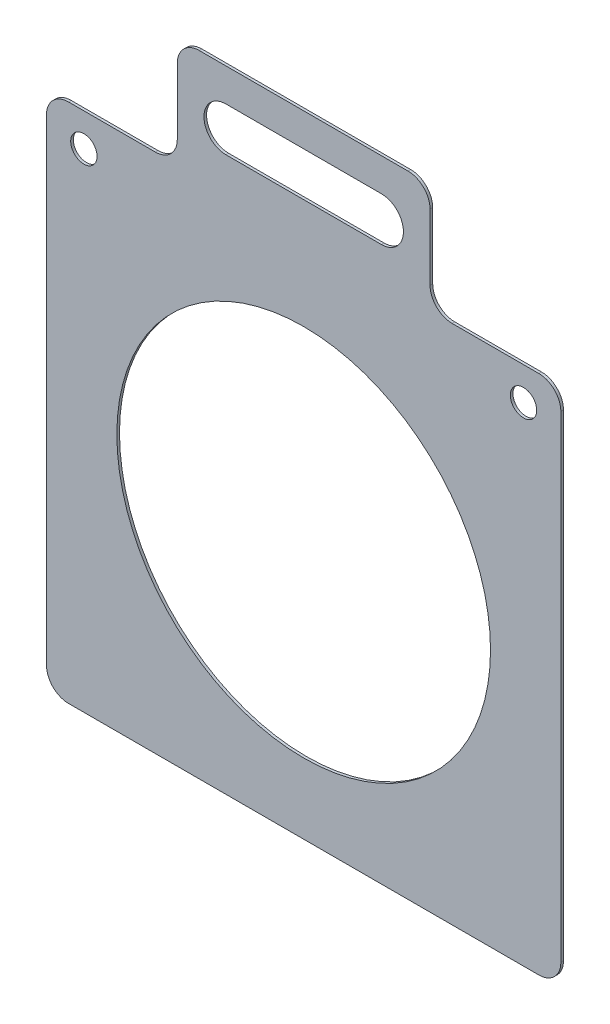
ISO-10303-21;
HEADER;
FILE_DESCRIPTION(('STEP AP214'),'2;1');
FILE_NAME('part.step','',(''),(''),'','','');
FILE_SCHEMA(('AUTOMOTIVE_DESIGN { 1 0 10303 214 1 1 1 1 }'));
ENDSEC;
DATA;
#1=APPLICATION_CONTEXT('core data for automotive mechanical design processes');
#2=APPLICATION_PROTOCOL_DEFINITION('international standard','automotive_design',2000,#1);
#3=PRODUCT_CONTEXT('',#1,'mechanical');
#4=PRODUCT('Part','Part','',(#3));
#5=PRODUCT_RELATED_PRODUCT_CATEGORY('part','',(#4));
#6=PRODUCT_DEFINITION_FORMATION('','',#4);
#7=PRODUCT_DEFINITION_CONTEXT('part definition',#1,'design');
#8=PRODUCT_DEFINITION('design','',#6,#7);
#9=PRODUCT_DEFINITION_SHAPE('','',#8);
#10=(LENGTH_UNIT() NAMED_UNIT(*) SI_UNIT(.MILLI.,.METRE.));
#11=(NAMED_UNIT(*) PLANE_ANGLE_UNIT() SI_UNIT($,.RADIAN.));
#12=(NAMED_UNIT(*) SI_UNIT($,.STERADIAN.) SOLID_ANGLE_UNIT());
#13=UNCERTAINTY_MEASURE_WITH_UNIT(LENGTH_MEASURE(1.E-05),#10,'distance_accuracy_value','');
#14=(GEOMETRIC_REPRESENTATION_CONTEXT(3) GLOBAL_UNCERTAINTY_ASSIGNED_CONTEXT((#13)) GLOBAL_UNIT_ASSIGNED_CONTEXT((#10,
#11,#12)) REPRESENTATION_CONTEXT('',''));
#15=CARTESIAN_POINT('',(0.,0.,0.));
#16=DIRECTION('',(0.,0.,1.));
#17=DIRECTION('',(1.,0.,0.));
#18=AXIS2_PLACEMENT_3D('',#15,#16,#17);
#19=CARTESIAN_POINT('',(-117.,120.000000000001,1.20000000000005));
#20=DIRECTION('',(0.,-1.,0.));
#21=DIRECTION('',(1.,0.,0.));
#22=AXIS2_PLACEMENT_3D('',#19,#20,#21);
#23=PLANE('',#22);
#24=DIRECTION('',(-1.,0.,0.));
#25=VECTOR('',#24,1.);
#26=CARTESIAN_POINT('',(-117.,120.000000000001,1.20000000000005));
#27=LINE('',#26,#25);
#28=CARTESIAN_POINT('',(-67.5000000000001,120.000000000001,1.20000000000005));
#29=VERTEX_POINT('',#28);
#30=CARTESIAN_POINT('',(-107.,120.,1.20000000000005));
#31=VERTEX_POINT('',#30);
#32=EDGE_CURVE('E276',#29,#31,#27,.T.);
#33=ORIENTED_EDGE('',*,*,#32,.F.);
#34=DIRECTION('',(0.,0.,1.));
#35=VECTOR('',#34,1.);
#36=CARTESIAN_POINT('',(-67.5000000000001,120.000000000001,1.20000000000005));
#37=LINE('',#36,#35);
#38=CARTESIAN_POINT('',(-67.5000000000001,120.000000000001,0.));
#39=VERTEX_POINT('',#38);
#40=EDGE_CURVE('E361',#29,#39,#37,.F.);
#41=ORIENTED_EDGE('',*,*,#40,.T.);
#42=DIRECTION('',(-1.,0.,0.));
#43=VECTOR('',#42,1.);
#44=CARTESIAN_POINT('',(-117.,120.000000000001,0.));
#45=LINE('',#44,#43);
#46=CARTESIAN_POINT('',(-107.,120.,0.));
#47=VERTEX_POINT('',#46);
#48=EDGE_CURVE('E291',#39,#47,#45,.T.);
#49=ORIENTED_EDGE('',*,*,#48,.T.);
#50=DIRECTION('',(0.,0.,-1.));
#51=VECTOR('',#50,1.);
#52=CARTESIAN_POINT('',(-107.,120.,1.20000000000005));
#53=LINE('',#52,#51);
#54=EDGE_CURVE('E358',#47,#31,#53,.F.);
#55=ORIENTED_EDGE('',*,*,#54,.T.);
#56=EDGE_LOOP('',(#33,#41,#49,#55));
#57=FACE_BOUND('',#56,.T.);
#58=ADVANCED_FACE('F40',(#57),#23,.F.);
#59=CARTESIAN_POINT('',(0.,0.,1.19999999999998));
#60=DIRECTION('',(0.,0.,1.));
#61=DIRECTION('',(1.,0.,0.));
#62=AXIS2_PLACEMENT_3D('',#59,#60,#61);
#63=PLANE('',#62);
#64=CARTESIAN_POINT('',(-100.,105.,1.20000000000005));
#65=DIRECTION('',(0.,0.,1.));
#66=DIRECTION('',(1.,0.,0.));
#67=AXIS2_PLACEMENT_3D('',#64,#65,#66);
#68=CIRCLE('',#67,6.);
#69=CARTESIAN_POINT('',(-94.0000000000003,105.,1.20000000000005));
#70=VERTEX_POINT('',#69);
#71=EDGE_CURVE('E247',#70,#70,#68,.T.);
#72=ORIENTED_EDGE('',*,*,#71,.F.);
#73=EDGE_LOOP('',(#72));
#74=FACE_BOUND('',#73,.T.);
#75=DIRECTION('',(0.,1.,0.));
#76=VECTOR('',#75,1.);
#77=CARTESIAN_POINT('',(57.5000000000002,170.000000000002,1.19999999999999));
#78=LINE('',#77,#76);
#79=CARTESIAN_POINT('',(57.5000000000003,130.000000000001,1.19999999999999));
#80=VERTEX_POINT('',#79);
#81=CARTESIAN_POINT('',(57.5000000000001,160.000000000002,1.19999999999999));
#82=VERTEX_POINT('',#81);
#83=EDGE_CURVE('E217',#80,#82,#78,.T.);
#84=ORIENTED_EDGE('',*,*,#83,.T.);
#85=CARTESIAN_POINT('',(47.5,160.000000000002,1.20000000000005));
#86=DIRECTION('',(0.,0.,1.));
#87=DIRECTION('',(1.,0.,0.));
#88=AXIS2_PLACEMENT_3D('',#85,#86,#87);
#89=CIRCLE('',#88,10.);
#90=CARTESIAN_POINT('',(47.5000000000002,170.000000000002,1.19999999999999));
#91=VERTEX_POINT('',#90);
#92=EDGE_CURVE('E325',#82,#91,#89,.T.);
#93=ORIENTED_EDGE('',*,*,#92,.T.);
#94=DIRECTION('',(-1.,0.,0.));
#95=VECTOR('',#94,1.);
#96=CARTESIAN_POINT('',(-57.5000000000002,170.000000000002,1.20000000000005));
#97=LINE('',#96,#95);
#98=CARTESIAN_POINT('',(-47.5000000000001,170.000000000002,1.20000000000005));
#99=VERTEX_POINT('',#98);
#100=EDGE_CURVE('E225',#91,#99,#97,.T.);
#101=ORIENTED_EDGE('',*,*,#100,.T.);
#102=CARTESIAN_POINT('',(-47.5,160.000000000002,1.20000000000005));
#103=DIRECTION('',(0.,0.,1.));
#104=DIRECTION('',(1.,0.,0.));
#105=AXIS2_PLACEMENT_3D('',#102,#103,#104);
#106=CIRCLE('',#105,10.);
#107=CARTESIAN_POINT('',(-57.5,160.000000000002,1.20000000000005));
#108=VERTEX_POINT('',#107);
#109=EDGE_CURVE('E322',#99,#108,#106,.T.);
#110=ORIENTED_EDGE('',*,*,#109,.T.);
#111=DIRECTION('',(0.,-1.,0.));
#112=VECTOR('',#111,1.);
#113=CARTESIAN_POINT('',(-57.4999999999999,120.000000000002,1.20000000000005));
#114=LINE('',#113,#112);
#115=CARTESIAN_POINT('',(-57.5000000000001,130.000000000001,1.19999999999998));
#116=VERTEX_POINT('',#115);
#117=EDGE_CURVE('E229',#108,#116,#114,.T.);
#118=ORIENTED_EDGE('',*,*,#117,.T.);
#119=CARTESIAN_POINT('',(-67.5,130.000000000001,1.20000000000004));
#120=DIRECTION('',(0.,0.,1.));
#121=DIRECTION('',(1.,0.,0.));
#122=AXIS2_PLACEMENT_3D('',#119,#120,#121);
#123=CIRCLE('',#122,10.);
#124=EDGE_CURVE('E49',#116,#29,#123,.F.);
#125=ORIENTED_EDGE('',*,*,#124,.T.);
#126=ORIENTED_EDGE('',*,*,#32,.T.);
#127=CARTESIAN_POINT('',(-107.,110.,1.20000000000005));
#128=DIRECTION('',(0.,0.,1.));
#129=DIRECTION('',(1.,0.,0.));
#130=AXIS2_PLACEMENT_3D('',#127,#128,#129);
#131=CIRCLE('',#130,10.);
#132=CARTESIAN_POINT('',(-117.,110.,1.20000000000005));
#133=VERTEX_POINT('',#132);
#134=EDGE_CURVE('E319',#31,#133,#131,.T.);
#135=ORIENTED_EDGE('',*,*,#134,.T.);
#136=DIRECTION('',(0.,-1.,0.));
#137=VECTOR('',#136,1.);
#138=CARTESIAN_POINT('',(-117.,120.000000000001,1.20000000000005));
#139=LINE('',#138,#137);
#140=CARTESIAN_POINT('',(-117.,-107.,1.20000000000003));
#141=VERTEX_POINT('',#140);
#142=EDGE_CURVE('E263',#133,#141,#139,.T.);
#143=ORIENTED_EDGE('',*,*,#142,.T.);
#144=CARTESIAN_POINT('',(-107.,-107.,1.20000000000003));
#145=DIRECTION('',(0.,0.,1.));
#146=DIRECTION('',(1.,0.,0.));
#147=AXIS2_PLACEMENT_3D('',#144,#145,#146);
#148=CIRCLE('',#147,10.);
#149=CARTESIAN_POINT('',(-107.,-117.,1.20000000000003));
#150=VERTEX_POINT('',#149);
#151=EDGE_CURVE('E313',#141,#150,#148,.T.);
#152=ORIENTED_EDGE('',*,*,#151,.T.);
#153=DIRECTION('',(1.,0.,0.));
#154=VECTOR('',#153,1.);
#155=CARTESIAN_POINT('',(-117.,-117.,1.20000000000003));
#156=LINE('',#155,#154);
#157=CARTESIAN_POINT('',(107.,-117.,1.19999999999998));
#158=VERTEX_POINT('',#157);
#159=EDGE_CURVE('E267',#150,#158,#156,.T.);
#160=ORIENTED_EDGE('',*,*,#159,.T.);
#161=CARTESIAN_POINT('',(107.,-107.,1.19999999999998));
#162=DIRECTION('',(0.,0.,1.));
#163=DIRECTION('',(1.,0.,0.));
#164=AXIS2_PLACEMENT_3D('',#161,#162,#163);
#165=CIRCLE('',#164,10.);
#166=CARTESIAN_POINT('',(117.,-107.,1.19999999999998));
#167=VERTEX_POINT('',#166);
#168=EDGE_CURVE('E316',#158,#167,#165,.T.);
#169=ORIENTED_EDGE('',*,*,#168,.T.);
#170=DIRECTION('',(0.,1.,0.));
#171=VECTOR('',#170,1.);
#172=CARTESIAN_POINT('',(117.,120.,1.19999999999998));
#173=LINE('',#172,#171);
#174=CARTESIAN_POINT('',(117.,110.,1.19999999999998));
#175=VERTEX_POINT('',#174);
#176=EDGE_CURVE('E272',#167,#175,#173,.T.);
#177=ORIENTED_EDGE('',*,*,#176,.T.);
#178=CARTESIAN_POINT('',(107.,110.000000000001,1.19999999999998));
#179=DIRECTION('',(0.,0.,1.));
#180=DIRECTION('',(1.,0.,0.));
#181=AXIS2_PLACEMENT_3D('',#178,#179,#180);
#182=CIRCLE('',#181,10.);
#183=CARTESIAN_POINT('',(107.,120.000000000001,1.19999999999998));
#184=VERTEX_POINT('',#183);
#185=EDGE_CURVE('E310',#175,#184,#182,.T.);
#186=ORIENTED_EDGE('',*,*,#185,.T.);
#187=CARTESIAN_POINT('',(67.5000000000001,120.000000000001,1.19999999999998));
#188=VERTEX_POINT('',#187);
#189=EDGE_CURVE('E280',#184,#188,#27,.T.);
#190=ORIENTED_EDGE('',*,*,#189,.T.);
#191=CARTESIAN_POINT('',(67.5000000000003,130.000000000001,1.19999999999998));
#192=DIRECTION('',(0.,0.,1.));
#193=DIRECTION('',(1.,0.,0.));
#194=AXIS2_PLACEMENT_3D('',#191,#192,#193);
#195=CIRCLE('',#194,10.);
#196=EDGE_CURVE('E384',#188,#80,#195,.F.);
#197=ORIENTED_EDGE('',*,*,#196,.T.);
#198=EDGE_LOOP('',(#84,#93,#101,#110,#118,#125,#126,#135,#143,#152,#160,#169,#177,#186,#190,#197));
#199=FACE_BOUND('',#198,.T.);
#200=CARTESIAN_POINT('',(0.,0.,1.19999999999998));
#201=DIRECTION('',(0.,0.,1.));
#202=DIRECTION('',(1.,0.,0.));
#203=AXIS2_PLACEMENT_3D('',#200,#201,#202);
#204=CIRCLE('',#203,85.);
#205=CARTESIAN_POINT('',(85.0000000000002,0.,1.19999999999998));
#206=VERTEX_POINT('',#205);
#207=EDGE_CURVE('E255',#206,#206,#204,.T.);
#208=ORIENTED_EDGE('',*,*,#207,.F.);
#209=EDGE_LOOP('',(#208));
#210=FACE_BOUND('',#209,.T.);
#211=CARTESIAN_POINT('',(100.,105.000000000001,1.19999999999998));
#212=DIRECTION('',(0.,0.,1.));
#213=DIRECTION('',(-1.,0.,0.));
#214=AXIS2_PLACEMENT_3D('',#211,#212,#213);
#215=CIRCLE('',#214,6.);
#216=CARTESIAN_POINT('',(94.0000000000002,105.000000000001,1.19999999999998));
#217=VERTEX_POINT('',#216);
#218=EDGE_CURVE('E237',#217,#217,#215,.T.);
#219=ORIENTED_EDGE('',*,*,#218,.F.);
#220=EDGE_LOOP('',(#219));
#221=FACE_BOUND('',#220,.T.);
#222=DIRECTION('',(1.,0.,0.));
#223=VECTOR('',#222,1.);
#224=CARTESIAN_POINT('',(-35.3706002300001,134.999999999999,1.20000000000005));
#225=LINE('',#224,#223);
#226=CARTESIAN_POINT('',(-35.3706002300001,134.999999999999,1.20000000000005));
#227=VERTEX_POINT('',#226);
#228=CARTESIAN_POINT('',(35.3706002300002,135.,1.19999999999999));
#229=VERTEX_POINT('',#228);
#230=EDGE_CURVE('E195',#227,#229,#225,.T.);
#231=ORIENTED_EDGE('',*,*,#230,.F.);
#232=CARTESIAN_POINT('',(-35.3706002300002,145.000000000002,1.20000000000005));
#233=DIRECTION('',(0.,0.,1.));
#234=DIRECTION('',(1.,0.,0.));
#235=AXIS2_PLACEMENT_3D('',#232,#233,#234);
#236=CIRCLE('',#235,10.0000000000015);
#237=CARTESIAN_POINT('',(-35.3706002300001,155.000000000002,1.20000000000005));
#238=VERTEX_POINT('',#237);
#239=EDGE_CURVE('E202',#238,#227,#236,.T.);
#240=ORIENTED_EDGE('',*,*,#239,.F.);
#241=DIRECTION('',(-1.,0.,0.));
#242=VECTOR('',#241,1.);
#243=CARTESIAN_POINT('',(-35.3706002300001,155.000000000002,1.20000000000005));
#244=LINE('',#243,#242);
#245=CARTESIAN_POINT('',(35.3706002300001,155.000000000002,1.19999999999999));
#246=VERTEX_POINT('',#245);
#247=EDGE_CURVE('E206',#246,#238,#244,.T.);
#248=ORIENTED_EDGE('',*,*,#247,.F.);
#249=CARTESIAN_POINT('',(35.3706002300001,145.000000000002,1.19999999999999));
#250=DIRECTION('',(0.,0.,1.));
#251=DIRECTION('',(1.,0.,0.));
#252=AXIS2_PLACEMENT_3D('',#249,#250,#251);
#253=CIRCLE('',#252,10.0000000000015);
#254=EDGE_CURVE('E185',#229,#246,#253,.T.);
#255=ORIENTED_EDGE('',*,*,#254,.F.);
#256=EDGE_LOOP('',(#231,#240,#248,#255));
#257=FACE_BOUND('',#256,.T.);
#258=ADVANCED_FACE('F204',(#74,#199,#210,#221,#257),#63,.T.);
#259=CARTESIAN_POINT('',(0.,0.,0.));
#260=DIRECTION('',(0.,0.,1.));
#261=DIRECTION('',(1.,0.,0.));
#262=AXIS2_PLACEMENT_3D('',#259,#260,#261);
#263=PLANE('',#262);
#264=DIRECTION('',(1.,0.,0.));
#265=VECTOR('',#264,1.);
#266=CARTESIAN_POINT('',(-57.5000000000002,170.000000000002,0.));
#267=LINE('',#266,#265);
#268=CARTESIAN_POINT('',(-47.5000000000001,170.000000000002,0.));
#269=VERTEX_POINT('',#268);
#270=CARTESIAN_POINT('',(47.5000000000002,170.000000000002,0.));
#271=VERTEX_POINT('',#270);
#272=EDGE_CURVE('E236',#269,#271,#267,.T.);
#273=ORIENTED_EDGE('',*,*,#272,.T.);
#274=CARTESIAN_POINT('',(47.5,160.000000000002,0.));
#275=DIRECTION('',(0.,0.,1.));
#276=DIRECTION('',(1.,0.,0.));
#277=AXIS2_PLACEMENT_3D('',#274,#275,#276);
#278=CIRCLE('',#277,10.);
#279=CARTESIAN_POINT('',(57.5000000000001,160.000000000002,0.));
#280=VERTEX_POINT('',#279);
#281=EDGE_CURVE('E348',#271,#280,#278,.F.);
#282=ORIENTED_EDGE('',*,*,#281,.T.);
#283=DIRECTION('',(0.,-1.,0.));
#284=VECTOR('',#283,1.);
#285=CARTESIAN_POINT('',(57.5000000000002,170.000000000002,0.));
#286=LINE('',#285,#284);
#287=CARTESIAN_POINT('',(57.5000000000003,130.000000000001,0.));
#288=VERTEX_POINT('',#287);
#289=EDGE_CURVE('E246',#280,#288,#286,.T.);
#290=ORIENTED_EDGE('',*,*,#289,.T.);
#291=CARTESIAN_POINT('',(67.5000000000003,130.000000000001,0.));
#292=DIRECTION('',(0.,0.,1.));
#293=DIRECTION('',(1.,0.,0.));
#294=AXIS2_PLACEMENT_3D('',#291,#292,#293);
#295=CIRCLE('',#294,10.);
#296=CARTESIAN_POINT('',(67.5000000000001,120.000000000001,0.));
#297=VERTEX_POINT('',#296);
#298=EDGE_CURVE('E387',#288,#297,#295,.T.);
#299=ORIENTED_EDGE('',*,*,#298,.T.);
#300=CARTESIAN_POINT('',(107.,120.000000000001,0.));
#301=VERTEX_POINT('',#300);
#302=EDGE_CURVE('E268',#301,#297,#45,.T.);
#303=ORIENTED_EDGE('',*,*,#302,.F.);
#304=CARTESIAN_POINT('',(107.,110.000000000001,0.));
#305=DIRECTION('',(0.,0.,1.));
#306=DIRECTION('',(1.,0.,0.));
#307=AXIS2_PLACEMENT_3D('',#304,#305,#306);
#308=CIRCLE('',#307,10.);
#309=CARTESIAN_POINT('',(117.,110.,0.));
#310=VERTEX_POINT('',#309);
#311=EDGE_CURVE('E335',#301,#310,#308,.F.);
#312=ORIENTED_EDGE('',*,*,#311,.T.);
#313=DIRECTION('',(0.,1.,0.));
#314=VECTOR('',#313,1.);
#315=CARTESIAN_POINT('',(117.,120.,0.));
#316=LINE('',#315,#314);
#317=CARTESIAN_POINT('',(117.,-107.,0.));
#318=VERTEX_POINT('',#317);
#319=EDGE_CURVE('E287',#318,#310,#316,.T.);
#320=ORIENTED_EDGE('',*,*,#319,.F.);
#321=CARTESIAN_POINT('',(107.,-107.,0.));
#322=DIRECTION('',(0.,0.,1.));
#323=DIRECTION('',(1.,0.,0.));
#324=AXIS2_PLACEMENT_3D('',#321,#322,#323);
#325=CIRCLE('',#324,10.);
#326=CARTESIAN_POINT('',(107.,-117.,0.));
#327=VERTEX_POINT('',#326);
#328=EDGE_CURVE('E56',#318,#327,#325,.F.);
#329=ORIENTED_EDGE('',*,*,#328,.T.);
#330=DIRECTION('',(1.,0.,0.));
#331=VECTOR('',#330,1.);
#332=CARTESIAN_POINT('',(-117.,-117.,0.));
#333=LINE('',#332,#331);
#334=CARTESIAN_POINT('',(-107.,-117.,0.));
#335=VERTEX_POINT('',#334);
#336=EDGE_CURVE('E284',#335,#327,#333,.T.);
#337=ORIENTED_EDGE('',*,*,#336,.F.);
#338=CARTESIAN_POINT('',(-107.,-107.,0.));
#339=DIRECTION('',(0.,0.,1.));
#340=DIRECTION('',(1.,0.,0.));
#341=AXIS2_PLACEMENT_3D('',#338,#339,#340);
#342=CIRCLE('',#341,10.);
#343=CARTESIAN_POINT('',(-117.,-107.,0.));
#344=VERTEX_POINT('',#343);
#345=EDGE_CURVE('E64',#335,#344,#342,.F.);
#346=ORIENTED_EDGE('',*,*,#345,.T.);
#347=DIRECTION('',(0.,-1.,0.));
#348=VECTOR('',#347,1.);
#349=CARTESIAN_POINT('',(-117.,120.000000000001,0.));
#350=LINE('',#349,#348);
#351=CARTESIAN_POINT('',(-117.,110.,0.));
#352=VERTEX_POINT('',#351);
#353=EDGE_CURVE('E259',#352,#344,#350,.T.);
#354=ORIENTED_EDGE('',*,*,#353,.F.);
#355=CARTESIAN_POINT('',(-107.,110.,0.));
#356=DIRECTION('',(0.,0.,1.));
#357=DIRECTION('',(1.,0.,0.));
#358=AXIS2_PLACEMENT_3D('',#355,#356,#357);
#359=CIRCLE('',#358,10.);
#360=EDGE_CURVE('E342',#352,#47,#359,.F.);
#361=ORIENTED_EDGE('',*,*,#360,.T.);
#362=ORIENTED_EDGE('',*,*,#48,.F.);
#363=CARTESIAN_POINT('',(-67.5,130.000000000001,0.));
#364=DIRECTION('',(0.,0.,1.));
#365=DIRECTION('',(1.,0.,0.));
#366=AXIS2_PLACEMENT_3D('',#363,#364,#365);
#367=CIRCLE('',#366,10.);
#368=CARTESIAN_POINT('',(-57.5000000000001,130.000000000001,0.));
#369=VERTEX_POINT('',#368);
#370=EDGE_CURVE('E11',#39,#369,#367,.T.);
#371=ORIENTED_EDGE('',*,*,#370,.T.);
#372=DIRECTION('',(0.,1.,0.));
#373=VECTOR('',#372,1.);
#374=CARTESIAN_POINT('',(-57.4999999999999,120.000000000002,0.));
#375=LINE('',#374,#373);
#376=CARTESIAN_POINT('',(-57.5,160.000000000002,0.));
#377=VERTEX_POINT('',#376);
#378=EDGE_CURVE('E410',#369,#377,#375,.T.);
#379=ORIENTED_EDGE('',*,*,#378,.T.);
#380=CARTESIAN_POINT('',(-47.5,160.000000000002,0.));
#381=DIRECTION('',(0.,0.,1.));
#382=DIRECTION('',(1.,0.,0.));
#383=AXIS2_PLACEMENT_3D('',#380,#381,#382);
#384=CIRCLE('',#383,10.);
#385=EDGE_CURVE('E345',#377,#269,#384,.F.);
#386=ORIENTED_EDGE('',*,*,#385,.T.);
#387=EDGE_LOOP('',(#273,#282,#290,#299,#303,#312,#320,#329,#337,#346,#354,#361,#362,#371,#379,#386));
#388=FACE_BOUND('',#387,.T.);
#389=CARTESIAN_POINT('',(0.,0.,0.));
#390=DIRECTION('',(0.,0.,1.));
#391=DIRECTION('',(1.,0.,0.));
#392=AXIS2_PLACEMENT_3D('',#389,#390,#391);
#393=CIRCLE('',#392,85.);
#394=CARTESIAN_POINT('',(85.0000000000002,0.,0.));
#395=VERTEX_POINT('',#394);
#396=EDGE_CURVE('E251',#395,#395,#393,.T.);
#397=ORIENTED_EDGE('',*,*,#396,.T.);
#398=EDGE_LOOP('',(#397));
#399=FACE_BOUND('',#398,.T.);
#400=CARTESIAN_POINT('',(-100.,105.,0.));
#401=DIRECTION('',(0.,0.,1.));
#402=DIRECTION('',(1.,0.,0.));
#403=AXIS2_PLACEMENT_3D('',#400,#401,#402);
#404=CIRCLE('',#403,6.);
#405=CARTESIAN_POINT('',(-94.0000000000003,105.,0.));
#406=VERTEX_POINT('',#405);
#407=EDGE_CURVE('E241',#406,#406,#404,.T.);
#408=ORIENTED_EDGE('',*,*,#407,.T.);
#409=EDGE_LOOP('',(#408));
#410=FACE_BOUND('',#409,.T.);
#411=CARTESIAN_POINT('',(100.,105.000000000001,0.));
#412=DIRECTION('',(0.,0.,1.));
#413=DIRECTION('',(-1.,0.,0.));
#414=AXIS2_PLACEMENT_3D('',#411,#412,#413);
#415=CIRCLE('',#414,6.);
#416=CARTESIAN_POINT('',(94.0000000000002,105.000000000001,0.));
#417=VERTEX_POINT('',#416);
#418=EDGE_CURVE('E242',#417,#417,#415,.T.);
#419=ORIENTED_EDGE('',*,*,#418,.T.);
#420=EDGE_LOOP('',(#419));
#421=FACE_BOUND('',#420,.T.);
#422=DIRECTION('',(-1.,0.,0.));
#423=VECTOR('',#422,1.);
#424=CARTESIAN_POINT('',(-35.3706002300001,134.999999999999,0.));
#425=LINE('',#424,#423);
#426=CARTESIAN_POINT('',(35.3706002300001,134.999999999999,0.));
#427=VERTEX_POINT('',#426);
#428=CARTESIAN_POINT('',(-35.3706002300001,134.999999999999,0.));
#429=VERTEX_POINT('',#428);
#430=EDGE_CURVE('E233',#427,#429,#425,.T.);
#431=ORIENTED_EDGE('',*,*,#430,.F.);
#432=CARTESIAN_POINT('',(35.3706002300001,145.000000000002,0.));
#433=DIRECTION('',(0.,0.,1.));
#434=DIRECTION('',(1.,0.,0.));
#435=AXIS2_PLACEMENT_3D('',#432,#433,#434);
#436=CIRCLE('',#435,10.0000000000015);
#437=CARTESIAN_POINT('',(35.3706002300001,155.000000000004,0.));
#438=VERTEX_POINT('',#437);
#439=EDGE_CURVE('E187',#438,#427,#436,.F.);
#440=ORIENTED_EDGE('',*,*,#439,.F.);
#441=DIRECTION('',(1.,0.,0.));
#442=VECTOR('',#441,1.);
#443=CARTESIAN_POINT('',(-35.3706002300001,155.000000000002,0.));
#444=LINE('',#443,#442);
#445=CARTESIAN_POINT('',(-35.3706002300001,155.000000000002,0.));
#446=VERTEX_POINT('',#445);
#447=EDGE_CURVE('E420',#446,#438,#444,.T.);
#448=ORIENTED_EDGE('',*,*,#447,.F.);
#449=CARTESIAN_POINT('',(-35.3706002300002,145.000000000002,0.));
#450=DIRECTION('',(0.,0.,1.));
#451=DIRECTION('',(1.,0.,0.));
#452=AXIS2_PLACEMENT_3D('',#449,#450,#451);
#453=CIRCLE('',#452,10.0000000000015);
#454=EDGE_CURVE('E415',#429,#446,#453,.F.);
#455=ORIENTED_EDGE('',*,*,#454,.F.);
#456=EDGE_LOOP('',(#431,#440,#448,#455));
#457=FACE_BOUND('',#456,.T.);
#458=ADVANCED_FACE('F408',(#388,#399,#410,#421,#457),#263,.F.);
#459=CARTESIAN_POINT('',(-117.,120.000000000001,1.20000000000005));
#460=DIRECTION('',(1.,0.,0.));
#461=DIRECTION('',(0.,1.,0.));
#462=AXIS2_PLACEMENT_3D('',#459,#460,#461);
#463=PLANE('',#462);
#464=ORIENTED_EDGE('',*,*,#142,.F.);
#465=DIRECTION('',(0.,0.,-1.));
#466=VECTOR('',#465,1.);
#467=CARTESIAN_POINT('',(-117.,110.,1.20000000000005));
#468=LINE('',#467,#466);
#469=EDGE_CURVE('E367',#133,#352,#468,.T.);
#470=ORIENTED_EDGE('',*,*,#469,.T.);
#471=ORIENTED_EDGE('',*,*,#353,.T.);
#472=DIRECTION('',(0.,0.,-1.));
#473=VECTOR('',#472,1.);
#474=CARTESIAN_POINT('',(-117.,-107.,1.20000000000003));
#475=LINE('',#474,#473);
#476=EDGE_CURVE('E364',#344,#141,#475,.F.);
#477=ORIENTED_EDGE('',*,*,#476,.T.);
#478=EDGE_LOOP('',(#464,#470,#471,#477));
#479=FACE_BOUND('',#478,.T.);
#480=ADVANCED_FACE('F482',(#479),#463,.F.);
#481=CARTESIAN_POINT('',(-117.,-117.,1.20000000000003));
#482=DIRECTION('',(0.,1.,0.));
#483=DIRECTION('',(-1.,0.,0.));
#484=AXIS2_PLACEMENT_3D('',#481,#482,#483);
#485=PLANE('',#484);
#486=ORIENTED_EDGE('',*,*,#336,.T.);
#487=DIRECTION('',(0.,0.,-1.));
#488=VECTOR('',#487,1.);
#489=CARTESIAN_POINT('',(107.,-117.,1.19999999999998));
#490=LINE('',#489,#488);
#491=EDGE_CURVE('E381',#327,#158,#490,.F.);
#492=ORIENTED_EDGE('',*,*,#491,.T.);
#493=ORIENTED_EDGE('',*,*,#159,.F.);
#494=DIRECTION('',(0.,0.,-1.));
#495=VECTOR('',#494,1.);
#496=CARTESIAN_POINT('',(-107.,-117.,1.20000000000003));
#497=LINE('',#496,#495);
#498=EDGE_CURVE('E378',#150,#335,#497,.T.);
#499=ORIENTED_EDGE('',*,*,#498,.T.);
#500=EDGE_LOOP('',(#486,#492,#493,#499));
#501=FACE_BOUND('',#500,.T.);
#502=ADVANCED_FACE('F476',(#501),#485,.F.);
#503=CARTESIAN_POINT('',(117.,120.,1.19999999999998));
#504=DIRECTION('',(-1.,0.,0.));
#505=DIRECTION('',(0.,-1.,0.));
#506=AXIS2_PLACEMENT_3D('',#503,#504,#505);
#507=PLANE('',#506);
#508=ORIENTED_EDGE('',*,*,#176,.F.);
#509=DIRECTION('',(0.,0.,-1.));
#510=VECTOR('',#509,1.);
#511=CARTESIAN_POINT('',(117.,-107.,1.19999999999998));
#512=LINE('',#511,#510);
#513=EDGE_CURVE('E374',#167,#318,#512,.T.);
#514=ORIENTED_EDGE('',*,*,#513,.T.);
#515=ORIENTED_EDGE('',*,*,#319,.T.);
#516=DIRECTION('',(0.,0.,-1.));
#517=VECTOR('',#516,1.);
#518=CARTESIAN_POINT('',(117.,110.,1.19999999999998));
#519=LINE('',#518,#517);
#520=EDGE_CURVE('E371',#310,#175,#519,.F.);
#521=ORIENTED_EDGE('',*,*,#520,.T.);
#522=EDGE_LOOP('',(#508,#514,#515,#521));
#523=FACE_BOUND('',#522,.T.);
#524=ADVANCED_FACE('F468',(#523),#507,.F.);
#525=ORIENTED_EDGE('',*,*,#302,.T.);
#526=DIRECTION('',(0.,0.,1.));
#527=VECTOR('',#526,1.);
#528=CARTESIAN_POINT('',(67.5000000000003,120.,1.19999999999998));
#529=LINE('',#528,#527);
#530=EDGE_CURVE('E299',#297,#188,#529,.T.);
#531=ORIENTED_EDGE('',*,*,#530,.T.);
#532=ORIENTED_EDGE('',*,*,#189,.F.);
#533=DIRECTION('',(0.,0.,-1.));
#534=VECTOR('',#533,1.);
#535=CARTESIAN_POINT('',(107.,120.,1.19999999999998));
#536=LINE('',#535,#534);
#537=EDGE_CURVE('E295',#184,#301,#536,.T.);
#538=ORIENTED_EDGE('',*,*,#537,.T.);
#539=EDGE_LOOP('',(#525,#531,#532,#538));
#540=FACE_BOUND('',#539,.T.);
#541=ADVANCED_FACE('F457',(#540),#23,.F.);
#542=CARTESIAN_POINT('',(0.,0.,1.19999999999998));
#543=DIRECTION('',(0.,0.,-1.));
#544=DIRECTION('',(-1.,0.,0.));
#545=AXIS2_PLACEMENT_3D('',#542,#543,#544);
#546=CYLINDRICAL_SURFACE('',#545,85.);
#547=ORIENTED_EDGE('',*,*,#207,.T.);
#548=EDGE_LOOP('',(#547));
#549=FACE_BOUND('',#548,.T.);
#550=ORIENTED_EDGE('',*,*,#396,.F.);
#551=EDGE_LOOP('',(#550));
#552=FACE_BOUND('',#551,.T.);
#553=ADVANCED_FACE('F505',(#549,#552),#546,.F.);
#554=CARTESIAN_POINT('',(-100.,105.,1.20000000000005));
#555=DIRECTION('',(0.,0.,-1.));
#556=DIRECTION('',(-1.,0.,0.));
#557=AXIS2_PLACEMENT_3D('',#554,#555,#556);
#558=CYLINDRICAL_SURFACE('',#557,6.);
#559=ORIENTED_EDGE('',*,*,#71,.T.);
#560=EDGE_LOOP('',(#559));
#561=FACE_BOUND('',#560,.T.);
#562=ORIENTED_EDGE('',*,*,#407,.F.);
#563=EDGE_LOOP('',(#562));
#564=FACE_BOUND('',#563,.T.);
#565=ADVANCED_FACE('F510',(#561,#564),#558,.F.);
#566=CARTESIAN_POINT('',(100.,105.000000000001,1.19999999999998));
#567=DIRECTION('',(0.,0.,-1.));
#568=DIRECTION('',(-1.,0.,0.));
#569=AXIS2_PLACEMENT_3D('',#566,#567,#568);
#570=CYLINDRICAL_SURFACE('',#569,6.);
#571=ORIENTED_EDGE('',*,*,#218,.T.);
#572=EDGE_LOOP('',(#571));
#573=FACE_BOUND('',#572,.T.);
#574=ORIENTED_EDGE('',*,*,#418,.F.);
#575=EDGE_LOOP('',(#574));
#576=FACE_BOUND('',#575,.T.);
#577=ADVANCED_FACE('F538',(#573,#576),#570,.F.);
#578=CARTESIAN_POINT('',(57.5000000000002,170.000000000002,-125.399362039845));
#579=DIRECTION('',(1.,0.,0.));
#580=DIRECTION('',(0.,1.,0.));
#581=AXIS2_PLACEMENT_3D('',#578,#579,#580);
#582=PLANE('',#581);
#583=ORIENTED_EDGE('',*,*,#83,.F.);
#584=DIRECTION('',(0.,0.,1.));
#585=VECTOR('',#584,1.);
#586=CARTESIAN_POINT('',(57.5000000000003,130.000000000001,-125.399362039845));
#587=LINE('',#586,#585);
#588=EDGE_CURVE('E307',#80,#288,#587,.F.);
#589=ORIENTED_EDGE('',*,*,#588,.T.);
#590=ORIENTED_EDGE('',*,*,#289,.F.);
#591=DIRECTION('',(0.,0.,1.));
#592=VECTOR('',#591,1.);
#593=CARTESIAN_POINT('',(57.5000000000002,160.000000000002,-125.399362039845));
#594=LINE('',#593,#592);
#595=EDGE_CURVE('E303',#280,#82,#594,.T.);
#596=ORIENTED_EDGE('',*,*,#595,.T.);
#597=EDGE_LOOP('',(#583,#589,#590,#596));
#598=FACE_BOUND('',#597,.T.);
#599=ADVANCED_FACE('F536',(#598),#582,.T.);
#600=CARTESIAN_POINT('',(-57.5000000000003,170.000000000002,-125.399362039845));
#601=DIRECTION('',(0.,1.,0.));
#602=DIRECTION('',(0.,0.,1.));
#603=AXIS2_PLACEMENT_3D('',#600,#601,#602);
#604=PLANE('',#603);
#605=ORIENTED_EDGE('',*,*,#100,.F.);
#606=DIRECTION('',(0.,0.,1.));
#607=VECTOR('',#606,1.);
#608=CARTESIAN_POINT('',(47.5000000000002,170.000000000002,-125.399362039845));
#609=LINE('',#608,#607);
#610=EDGE_CURVE('E332',#91,#271,#609,.F.);
#611=ORIENTED_EDGE('',*,*,#610,.T.);
#612=ORIENTED_EDGE('',*,*,#272,.F.);
#613=DIRECTION('',(0.,0.,1.));
#614=VECTOR('',#613,1.);
#615=CARTESIAN_POINT('',(-47.5000000000002,170.000000000002,-125.399362039845));
#616=LINE('',#615,#614);
#617=EDGE_CURVE('E328',#269,#99,#616,.T.);
#618=ORIENTED_EDGE('',*,*,#617,.T.);
#619=EDGE_LOOP('',(#605,#611,#612,#618));
#620=FACE_BOUND('',#619,.T.);
#621=ADVANCED_FACE('F534',(#620),#604,.T.);
#622=CARTESIAN_POINT('',(-57.4999999999999,120.000000000002,-125.399362039845));
#623=DIRECTION('',(-1.,0.,0.));
#624=DIRECTION('',(0.,0.,1.));
#625=AXIS2_PLACEMENT_3D('',#622,#623,#624);
#626=PLANE('',#625);
#627=ORIENTED_EDGE('',*,*,#117,.F.);
#628=DIRECTION('',(0.,0.,1.));
#629=VECTOR('',#628,1.);
#630=CARTESIAN_POINT('',(-57.5000000000002,160.000000000002,-125.399362039845));
#631=LINE('',#630,#629);
#632=EDGE_CURVE('E355',#108,#377,#631,.F.);
#633=ORIENTED_EDGE('',*,*,#632,.T.);
#634=ORIENTED_EDGE('',*,*,#378,.F.);
#635=DIRECTION('',(0.,0.,1.));
#636=VECTOR('',#635,1.);
#637=CARTESIAN_POINT('',(-57.5000000000003,130.000000000001,-125.399362039845));
#638=LINE('',#637,#636);
#639=EDGE_CURVE('E351',#369,#116,#638,.T.);
#640=ORIENTED_EDGE('',*,*,#639,.T.);
#641=EDGE_LOOP('',(#627,#633,#634,#640));
#642=FACE_BOUND('',#641,.T.);
#643=ADVANCED_FACE('F413',(#642),#626,.T.);
#644=CARTESIAN_POINT('',(-35.3706002300003,134.999999999999,-125.399362039845));
#645=DIRECTION('',(0.,-1.,0.));
#646=DIRECTION('',(0.,0.,-1.));
#647=AXIS2_PLACEMENT_3D('',#644,#645,#646);
#648=PLANE('',#647);
#649=DIRECTION('',(0.,0.,1.));
#650=VECTOR('',#649,1.);
#651=CARTESIAN_POINT('',(35.3706002300001,135.,-125.399362039845));
#652=LINE('',#651,#650);
#653=EDGE_CURVE('E180',#427,#229,#652,.T.);
#654=ORIENTED_EDGE('',*,*,#653,.F.);
#655=ORIENTED_EDGE('',*,*,#430,.T.);
#656=DIRECTION('',(0.,0.,1.));
#657=VECTOR('',#656,1.);
#658=CARTESIAN_POINT('',(-35.3706002300003,134.999999999999,-125.399362039845));
#659=LINE('',#658,#657);
#660=EDGE_CURVE('E192',#429,#227,#659,.T.);
#661=ORIENTED_EDGE('',*,*,#660,.T.);
#662=ORIENTED_EDGE('',*,*,#230,.T.);
#663=EDGE_LOOP('',(#654,#655,#661,#662));
#664=FACE_BOUND('',#663,.T.);
#665=ADVANCED_FACE('F196',(#664),#648,.F.);
#666=CARTESIAN_POINT('',(35.3706002300001,145.000000000002,-125.399362039845));
#667=DIRECTION('',(0.,0.,1.));
#668=DIRECTION('',(1.,0.,0.));
#669=AXIS2_PLACEMENT_3D('',#666,#667,#668);
#670=CYLINDRICAL_SURFACE('',#669,10.0000000000015);
#671=DIRECTION('',(0.,0.,1.));
#672=VECTOR('',#671,1.);
#673=CARTESIAN_POINT('',(35.3706002300001,155.000000000002,-125.399362039845));
#674=LINE('',#673,#672);
#675=EDGE_CURVE('E191',#438,#246,#674,.T.);
#676=ORIENTED_EDGE('',*,*,#675,.F.);
#677=ORIENTED_EDGE('',*,*,#439,.T.);
#678=ORIENTED_EDGE('',*,*,#653,.T.);
#679=ORIENTED_EDGE('',*,*,#254,.T.);
#680=EDGE_LOOP('',(#676,#677,#678,#679));
#681=FACE_BOUND('',#680,.T.);
#682=ADVANCED_FACE('F183',(#681),#670,.F.);
#683=CARTESIAN_POINT('',(-35.3706002300002,155.000000000002,-125.399362039845));
#684=DIRECTION('',(0.,1.,0.));
#685=DIRECTION('',(0.,0.,1.));
#686=AXIS2_PLACEMENT_3D('',#683,#684,#685);
#687=PLANE('',#686);
#688=DIRECTION('',(0.,0.,1.));
#689=VECTOR('',#688,1.);
#690=CARTESIAN_POINT('',(-35.3706002300002,155.000000000002,-125.399362039845));
#691=LINE('',#690,#689);
#692=EDGE_CURVE('E214',#446,#238,#691,.T.);
#693=ORIENTED_EDGE('',*,*,#692,.F.);
#694=ORIENTED_EDGE('',*,*,#447,.T.);
#695=ORIENTED_EDGE('',*,*,#675,.T.);
#696=ORIENTED_EDGE('',*,*,#247,.T.);
#697=EDGE_LOOP('',(#693,#694,#695,#696));
#698=FACE_BOUND('',#697,.T.);
#699=ADVANCED_FACE('F433',(#698),#687,.F.);
#700=CARTESIAN_POINT('',(-35.3706002300002,145.000000000002,-125.399362039845));
#701=DIRECTION('',(0.,0.,1.));
#702=DIRECTION('',(1.,0.,0.));
#703=AXIS2_PLACEMENT_3D('',#700,#701,#702);
#704=CYLINDRICAL_SURFACE('',#703,10.0000000000015);
#705=ORIENTED_EDGE('',*,*,#660,.F.);
#706=ORIENTED_EDGE('',*,*,#454,.T.);
#707=ORIENTED_EDGE('',*,*,#692,.T.);
#708=ORIENTED_EDGE('',*,*,#239,.T.);
#709=EDGE_LOOP('',(#705,#706,#707,#708));
#710=FACE_BOUND('',#709,.T.);
#711=ADVANCED_FACE('F429',(#710),#704,.F.);
#712=CARTESIAN_POINT('',(67.5000000000003,130.000000000001,1.19999999999998));
#713=DIRECTION('',(0.,0.,1.));
#714=DIRECTION('',(1.,0.,0.));
#715=AXIS2_PLACEMENT_3D('',#712,#713,#714);
#716=CYLINDRICAL_SURFACE('',#715,10.);
#717=ORIENTED_EDGE('',*,*,#298,.F.);
#718=ORIENTED_EDGE('',*,*,#588,.F.);
#719=ORIENTED_EDGE('',*,*,#196,.F.);
#720=ORIENTED_EDGE('',*,*,#530,.F.);
#721=EDGE_LOOP('',(#717,#718,#719,#720));
#722=FACE_BOUND('',#721,.T.);
#723=ADVANCED_FACE('F453',(#722),#716,.F.);
#724=CARTESIAN_POINT('',(47.5,160.000000000002,-125.399362039845));
#725=DIRECTION('',(0.,0.,1.));
#726=DIRECTION('',(1.,0.,0.));
#727=AXIS2_PLACEMENT_3D('',#724,#725,#726);
#728=CYLINDRICAL_SURFACE('',#727,10.);
#729=ORIENTED_EDGE('',*,*,#281,.F.);
#730=ORIENTED_EDGE('',*,*,#610,.F.);
#731=ORIENTED_EDGE('',*,*,#92,.F.);
#732=ORIENTED_EDGE('',*,*,#595,.F.);
#733=EDGE_LOOP('',(#729,#730,#731,#732));
#734=FACE_BOUND('',#733,.T.);
#735=ADVANCED_FACE('F522',(#734),#728,.T.);
#736=CARTESIAN_POINT('',(-47.5000000000001,160.000000000002,-125.399362039845));
#737=DIRECTION('',(0.,0.,1.));
#738=DIRECTION('',(1.,0.,0.));
#739=AXIS2_PLACEMENT_3D('',#736,#737,#738);
#740=CYLINDRICAL_SURFACE('',#739,10.);
#741=ORIENTED_EDGE('',*,*,#385,.F.);
#742=ORIENTED_EDGE('',*,*,#632,.F.);
#743=ORIENTED_EDGE('',*,*,#109,.F.);
#744=ORIENTED_EDGE('',*,*,#617,.F.);
#745=EDGE_LOOP('',(#741,#742,#743,#744));
#746=FACE_BOUND('',#745,.T.);
#747=ADVANCED_FACE('F493',(#746),#740,.T.);
#748=CARTESIAN_POINT('',(-67.5000000000003,130.000000000001,-125.399362039845));
#749=DIRECTION('',(0.,0.,1.));
#750=DIRECTION('',(1.,0.,0.));
#751=AXIS2_PLACEMENT_3D('',#748,#749,#750);
#752=CYLINDRICAL_SURFACE('',#751,10.);
#753=ORIENTED_EDGE('',*,*,#370,.F.);
#754=ORIENTED_EDGE('',*,*,#40,.F.);
#755=ORIENTED_EDGE('',*,*,#124,.F.);
#756=ORIENTED_EDGE('',*,*,#639,.F.);
#757=EDGE_LOOP('',(#753,#754,#755,#756));
#758=FACE_BOUND('',#757,.T.);
#759=ADVANCED_FACE('F404',(#758),#752,.F.);
#760=CARTESIAN_POINT('',(-107.,110.,1.20000000000005));
#761=DIRECTION('',(0.,0.,-1.));
#762=DIRECTION('',(-1.,0.,0.));
#763=AXIS2_PLACEMENT_3D('',#760,#761,#762);
#764=CYLINDRICAL_SURFACE('',#763,10.);
#765=ORIENTED_EDGE('',*,*,#134,.F.);
#766=ORIENTED_EDGE('',*,*,#54,.F.);
#767=ORIENTED_EDGE('',*,*,#360,.F.);
#768=ORIENTED_EDGE('',*,*,#469,.F.);
#769=EDGE_LOOP('',(#765,#766,#767,#768));
#770=FACE_BOUND('',#769,.T.);
#771=ADVANCED_FACE('F485',(#770),#764,.T.);
#772=CARTESIAN_POINT('',(107.,-107.,1.19999999999998));
#773=DIRECTION('',(0.,0.,-1.));
#774=DIRECTION('',(-1.,0.,0.));
#775=AXIS2_PLACEMENT_3D('',#772,#773,#774);
#776=CYLINDRICAL_SURFACE('',#775,10.);
#777=ORIENTED_EDGE('',*,*,#168,.F.);
#778=ORIENTED_EDGE('',*,*,#491,.F.);
#779=ORIENTED_EDGE('',*,*,#328,.F.);
#780=ORIENTED_EDGE('',*,*,#513,.F.);
#781=EDGE_LOOP('',(#777,#778,#779,#780));
#782=FACE_BOUND('',#781,.T.);
#783=ADVANCED_FACE('F472',(#782),#776,.T.);
#784=CARTESIAN_POINT('',(-107.,-107.,1.20000000000003));
#785=DIRECTION('',(0.,0.,-1.));
#786=DIRECTION('',(-1.,0.,0.));
#787=AXIS2_PLACEMENT_3D('',#784,#785,#786);
#788=CYLINDRICAL_SURFACE('',#787,10.);
#789=ORIENTED_EDGE('',*,*,#151,.F.);
#790=ORIENTED_EDGE('',*,*,#476,.F.);
#791=ORIENTED_EDGE('',*,*,#345,.F.);
#792=ORIENTED_EDGE('',*,*,#498,.F.);
#793=EDGE_LOOP('',(#789,#790,#791,#792));
#794=FACE_BOUND('',#793,.T.);
#795=ADVANCED_FACE('F479',(#794),#788,.T.);
#796=CARTESIAN_POINT('',(107.,110.000000000001,1.19999999999998));
#797=DIRECTION('',(0.,0.,-1.));
#798=DIRECTION('',(-1.,0.,0.));
#799=AXIS2_PLACEMENT_3D('',#796,#797,#798);
#800=CYLINDRICAL_SURFACE('',#799,10.);
#801=ORIENTED_EDGE('',*,*,#185,.F.);
#802=ORIENTED_EDGE('',*,*,#520,.F.);
#803=ORIENTED_EDGE('',*,*,#311,.F.);
#804=ORIENTED_EDGE('',*,*,#537,.F.);
#805=EDGE_LOOP('',(#801,#802,#803,#804));
#806=FACE_BOUND('',#805,.T.);
#807=ADVANCED_FACE('F42',(#806),#800,.T.);
#808=CLOSED_SHELL('',(#58,#258,#458,#480,#502,#524,#541,#553,#565,#577,#599,#621,#643,#665,#682,
#699,#711,#723,#735,#747,#759,#771,#783,#795,#807));
#809=MANIFOLD_SOLID_BREP('B2',#808);
#810=ADVANCED_BREP_SHAPE_REPRESENTATION('',(#18,#809),#14);
#811=SHAPE_DEFINITION_REPRESENTATION(#9,#810);
ENDSEC;
END-ISO-10303-21;
